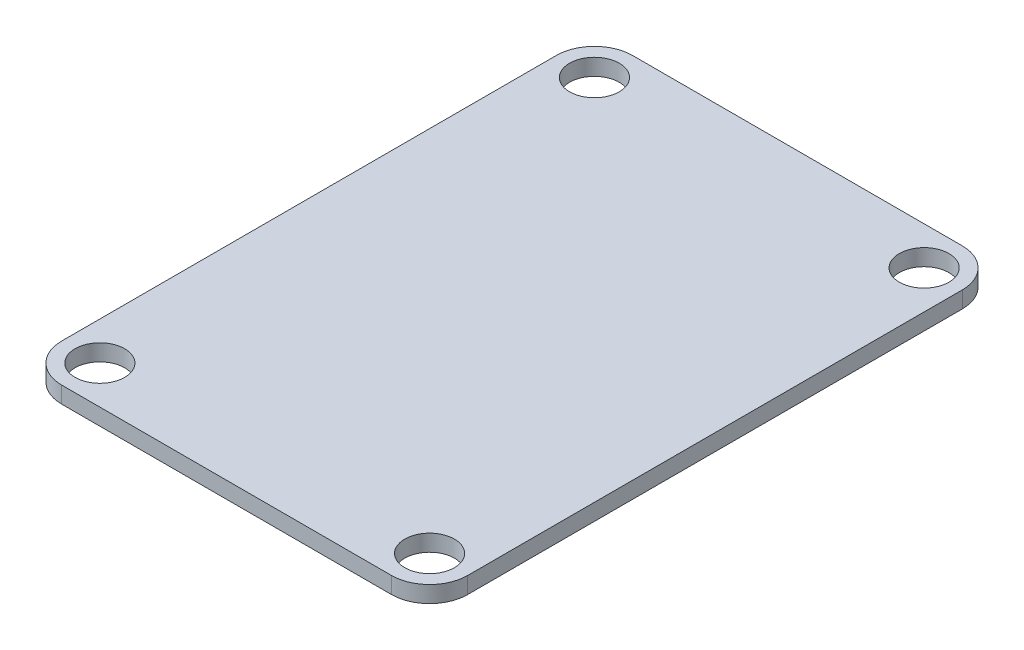
ISO-10303-21;
HEADER;
FILE_DESCRIPTION(('STEP AP214'),'2;1');
FILE_NAME('part.step','',(''),(''),'','','');
FILE_SCHEMA(('AUTOMOTIVE_DESIGN { 1 0 10303 214 1 1 1 1 }'));
ENDSEC;
DATA;
#1=APPLICATION_CONTEXT('core data for automotive mechanical design processes');
#2=APPLICATION_PROTOCOL_DEFINITION('international standard','automotive_design',2000,#1);
#3=PRODUCT_CONTEXT('',#1,'mechanical');
#4=PRODUCT('Part','Part','',(#3));
#5=PRODUCT_RELATED_PRODUCT_CATEGORY('part','',(#4));
#6=PRODUCT_DEFINITION_FORMATION('','',#4);
#7=PRODUCT_DEFINITION_CONTEXT('part definition',#1,'design');
#8=PRODUCT_DEFINITION('design','',#6,#7);
#9=PRODUCT_DEFINITION_SHAPE('','',#8);
#10=(LENGTH_UNIT() NAMED_UNIT(*) SI_UNIT(.MILLI.,.METRE.));
#11=(NAMED_UNIT(*) PLANE_ANGLE_UNIT() SI_UNIT($,.RADIAN.));
#12=(NAMED_UNIT(*) SI_UNIT($,.STERADIAN.) SOLID_ANGLE_UNIT());
#13=UNCERTAINTY_MEASURE_WITH_UNIT(LENGTH_MEASURE(1.E-05),#10,'distance_accuracy_value','');
#14=(GEOMETRIC_REPRESENTATION_CONTEXT(3) GLOBAL_UNCERTAINTY_ASSIGNED_CONTEXT((#13)) GLOBAL_UNIT_ASSIGNED_CONTEXT((#10,
#11,#12)) REPRESENTATION_CONTEXT('',''));
#15=CARTESIAN_POINT('',(0.,0.,0.));
#16=DIRECTION('',(0.,0.,1.));
#17=DIRECTION('',(1.,0.,0.));
#18=AXIS2_PLACEMENT_3D('',#15,#16,#17);
#19=CARTESIAN_POINT('',(-15.94,1.6,23.91));
#20=DIRECTION('',(0.,1.,0.));
#21=DIRECTION('',(0.,0.,1.));
#22=AXIS2_PLACEMENT_3D('',#19,#20,#21);
#23=PLANE('',#22);
#24=CARTESIAN_POINT('',(-15.94,1.6,23.91));
#25=DIRECTION('',(0.,1.,0.));
#26=DIRECTION('',(0.,0.,1.));
#27=AXIS2_PLACEMENT_3D('',#24,#25,#26);
#28=CIRCLE('',#27,2.4);
#29=CARTESIAN_POINT('',(-15.94,1.6,26.31));
#30=VERTEX_POINT('',#29);
#31=EDGE_CURVE('E188',#30,#30,#28,.T.);
#32=ORIENTED_EDGE('',*,*,#31,.F.);
#33=EDGE_LOOP('',(#32));
#34=FACE_BOUND('',#33,.T.);
#35=CARTESIAN_POINT('',(15.94,1.6,-23.91));
#36=DIRECTION('',(0.,1.,0.));
#37=DIRECTION('',(0.,0.,1.));
#38=AXIS2_PLACEMENT_3D('',#35,#36,#37);
#39=CIRCLE('',#38,2.4);
#40=CARTESIAN_POINT('',(15.94,1.6,-21.51));
#41=VERTEX_POINT('',#40);
#42=EDGE_CURVE('E134',#41,#41,#39,.T.);
#43=ORIENTED_EDGE('',*,*,#42,.F.);
#44=EDGE_LOOP('',(#43));
#45=FACE_BOUND('',#44,.T.);
#46=CARTESIAN_POINT('',(-15.94,1.6,23.91));
#47=DIRECTION('',(0.,1.,0.));
#48=DIRECTION('',(0.,0.,1.));
#49=AXIS2_PLACEMENT_3D('',#46,#47,#48);
#50=CIRCLE('',#49,3.69);
#51=CARTESIAN_POINT('',(-19.63,1.6,23.91));
#52=VERTEX_POINT('',#51);
#53=CARTESIAN_POINT('',(-15.94,1.6,27.6));
#54=VERTEX_POINT('',#53);
#55=EDGE_CURVE('E145',#52,#54,#50,.T.);
#56=ORIENTED_EDGE('',*,*,#55,.T.);
#57=DIRECTION('',(1.,0.,0.));
#58=VECTOR('',#57,1.);
#59=CARTESIAN_POINT('',(-15.94,1.6,27.6));
#60=LINE('',#59,#58);
#61=CARTESIAN_POINT('',(15.94,1.6,27.6));
#62=VERTEX_POINT('',#61);
#63=EDGE_CURVE('E93',#54,#62,#60,.T.);
#64=ORIENTED_EDGE('',*,*,#63,.T.);
#65=CARTESIAN_POINT('',(15.94,1.6,23.91));
#66=DIRECTION('',(0.,1.,0.));
#67=DIRECTION('',(0.,0.,1.));
#68=AXIS2_PLACEMENT_3D('',#65,#66,#67);
#69=CIRCLE('',#68,3.69);
#70=CARTESIAN_POINT('',(19.63,1.6,23.91));
#71=VERTEX_POINT('',#70);
#72=EDGE_CURVE('E160',#62,#71,#69,.T.);
#73=ORIENTED_EDGE('',*,*,#72,.T.);
#74=DIRECTION('',(0.,0.,-1.));
#75=VECTOR('',#74,1.);
#76=CARTESIAN_POINT('',(19.63,1.6,-23.91));
#77=LINE('',#76,#75);
#78=CARTESIAN_POINT('',(19.63,1.6,-23.91));
#79=VERTEX_POINT('',#78);
#80=EDGE_CURVE('E173',#71,#79,#77,.T.);
#81=ORIENTED_EDGE('',*,*,#80,.T.);
#82=CARTESIAN_POINT('',(15.94,1.6,-23.91));
#83=DIRECTION('',(0.,1.,0.));
#84=DIRECTION('',(0.,0.,-1.));
#85=AXIS2_PLACEMENT_3D('',#82,#83,#84);
#86=CIRCLE('',#85,3.68999999999999);
#87=CARTESIAN_POINT('',(15.94,1.6,-27.6));
#88=VERTEX_POINT('',#87);
#89=EDGE_CURVE('E112',#79,#88,#86,.T.);
#90=ORIENTED_EDGE('',*,*,#89,.T.);
#91=DIRECTION('',(-1.,0.,0.));
#92=VECTOR('',#91,1.);
#93=CARTESIAN_POINT('',(-15.94,1.6,-27.6));
#94=LINE('',#93,#92);
#95=CARTESIAN_POINT('',(-15.94,1.6,-27.6));
#96=VERTEX_POINT('',#95);
#97=EDGE_CURVE('E106',#88,#96,#94,.T.);
#98=ORIENTED_EDGE('',*,*,#97,.T.);
#99=CARTESIAN_POINT('',(-15.94,1.6,-23.91));
#100=DIRECTION('',(0.,1.,0.));
#101=DIRECTION('',(0.,0.,1.));
#102=AXIS2_PLACEMENT_3D('',#99,#100,#101);
#103=CIRCLE('',#102,3.69);
#104=CARTESIAN_POINT('',(-19.63,1.6,-23.91));
#105=VERTEX_POINT('',#104);
#106=EDGE_CURVE('E110',#96,#105,#103,.T.);
#107=ORIENTED_EDGE('',*,*,#106,.T.);
#108=DIRECTION('',(0.,0.,1.));
#109=VECTOR('',#108,1.);
#110=CARTESIAN_POINT('',(-19.63,1.6,-23.91));
#111=LINE('',#110,#109);
#112=EDGE_CURVE('E50',#105,#52,#111,.T.);
#113=ORIENTED_EDGE('',*,*,#112,.T.);
#114=EDGE_LOOP('',(#56,#64,#73,#81,#90,#98,#107,#113));
#115=FACE_BOUND('',#114,.T.);
#116=CARTESIAN_POINT('',(15.94,1.6,23.91));
#117=DIRECTION('',(0.,1.,0.));
#118=DIRECTION('',(0.,0.,1.));
#119=AXIS2_PLACEMENT_3D('',#116,#117,#118);
#120=CIRCLE('',#119,2.4);
#121=CARTESIAN_POINT('',(15.94,1.6,26.31));
#122=VERTEX_POINT('',#121);
#123=EDGE_CURVE('E182',#122,#122,#120,.T.);
#124=ORIENTED_EDGE('',*,*,#123,.F.);
#125=EDGE_LOOP('',(#124));
#126=FACE_BOUND('',#125,.T.);
#127=CARTESIAN_POINT('',(-15.94,1.6,-23.91));
#128=DIRECTION('',(0.,1.,0.));
#129=DIRECTION('',(0.,0.,1.));
#130=AXIS2_PLACEMENT_3D('',#127,#128,#129);
#131=CIRCLE('',#130,2.4);
#132=CARTESIAN_POINT('',(-15.94,1.6,-21.51));
#133=VERTEX_POINT('',#132);
#134=EDGE_CURVE('E194',#133,#133,#131,.T.);
#135=ORIENTED_EDGE('',*,*,#134,.F.);
#136=EDGE_LOOP('',(#135));
#137=FACE_BOUND('',#136,.T.);
#138=ADVANCED_FACE('F33',(#34,#45,#115,#126,#137),#23,.T.);
#139=CARTESIAN_POINT('',(-15.94,0.,23.91));
#140=DIRECTION('',(0.,1.,0.));
#141=DIRECTION('',(0.,0.,1.));
#142=AXIS2_PLACEMENT_3D('',#139,#140,#141);
#143=PLANE('',#142);
#144=CARTESIAN_POINT('',(-15.94,0.,23.91));
#145=DIRECTION('',(0.,1.,0.));
#146=DIRECTION('',(0.,0.,1.));
#147=AXIS2_PLACEMENT_3D('',#144,#145,#146);
#148=CIRCLE('',#147,2.4);
#149=CARTESIAN_POINT('',(-15.94,0.,26.31));
#150=VERTEX_POINT('',#149);
#151=EDGE_CURVE('E191',#150,#150,#148,.T.);
#152=ORIENTED_EDGE('',*,*,#151,.T.);
#153=EDGE_LOOP('',(#152));
#154=FACE_BOUND('',#153,.T.);
#155=CARTESIAN_POINT('',(15.94,0.,-23.91));
#156=DIRECTION('',(0.,1.,0.));
#157=DIRECTION('',(0.,0.,1.));
#158=AXIS2_PLACEMENT_3D('',#155,#156,#157);
#159=CIRCLE('',#158,2.4);
#160=CARTESIAN_POINT('',(15.94,0.,-21.51));
#161=VERTEX_POINT('',#160);
#162=EDGE_CURVE('E179',#161,#161,#159,.T.);
#163=ORIENTED_EDGE('',*,*,#162,.T.);
#164=EDGE_LOOP('',(#163));
#165=FACE_BOUND('',#164,.T.);
#166=CARTESIAN_POINT('',(-15.94,0.,23.91));
#167=DIRECTION('',(0.,1.,0.));
#168=DIRECTION('',(0.,0.,1.));
#169=AXIS2_PLACEMENT_3D('',#166,#167,#168);
#170=CIRCLE('',#169,3.69);
#171=CARTESIAN_POINT('',(-19.63,0.,23.91));
#172=VERTEX_POINT('',#171);
#173=CARTESIAN_POINT('',(-15.94,0.,27.6));
#174=VERTEX_POINT('',#173);
#175=EDGE_CURVE('E130',#172,#174,#170,.T.);
#176=ORIENTED_EDGE('',*,*,#175,.F.);
#177=DIRECTION('',(0.,0.,1.));
#178=VECTOR('',#177,1.);
#179=CARTESIAN_POINT('',(-19.63,0.,-23.91));
#180=LINE('',#179,#178);
#181=CARTESIAN_POINT('',(-19.63,0.,-23.91));
#182=VERTEX_POINT('',#181);
#183=EDGE_CURVE('E85',#182,#172,#180,.T.);
#184=ORIENTED_EDGE('',*,*,#183,.F.);
#185=CARTESIAN_POINT('',(-15.94,0.,-23.91));
#186=DIRECTION('',(0.,1.,0.));
#187=DIRECTION('',(0.,0.,1.));
#188=AXIS2_PLACEMENT_3D('',#185,#186,#187);
#189=CIRCLE('',#188,3.69);
#190=CARTESIAN_POINT('',(-15.94,0.,-27.6));
#191=VERTEX_POINT('',#190);
#192=EDGE_CURVE('E79',#191,#182,#189,.T.);
#193=ORIENTED_EDGE('',*,*,#192,.F.);
#194=DIRECTION('',(-1.,0.,0.));
#195=VECTOR('',#194,1.);
#196=CARTESIAN_POINT('',(-15.94,0.,-27.6));
#197=LINE('',#196,#195);
#198=CARTESIAN_POINT('',(15.94,0.,-27.6));
#199=VERTEX_POINT('',#198);
#200=EDGE_CURVE('E120',#199,#191,#197,.T.);
#201=ORIENTED_EDGE('',*,*,#200,.F.);
#202=CARTESIAN_POINT('',(15.94,0.,-23.91));
#203=DIRECTION('',(0.,1.,0.));
#204=DIRECTION('',(0.,0.,-1.));
#205=AXIS2_PLACEMENT_3D('',#202,#203,#204);
#206=CIRCLE('',#205,3.68999999999999);
#207=CARTESIAN_POINT('',(19.63,0.,-23.91));
#208=VERTEX_POINT('',#207);
#209=EDGE_CURVE('E140',#208,#199,#206,.T.);
#210=ORIENTED_EDGE('',*,*,#209,.F.);
#211=DIRECTION('',(0.,0.,-1.));
#212=VECTOR('',#211,1.);
#213=CARTESIAN_POINT('',(19.63,0.,-23.91));
#214=LINE('',#213,#212);
#215=CARTESIAN_POINT('',(19.63,0.,23.91));
#216=VERTEX_POINT('',#215);
#217=EDGE_CURVE('E138',#216,#208,#214,.T.);
#218=ORIENTED_EDGE('',*,*,#217,.F.);
#219=CARTESIAN_POINT('',(15.94,0.,23.91));
#220=DIRECTION('',(0.,1.,0.));
#221=DIRECTION('',(0.,0.,1.));
#222=AXIS2_PLACEMENT_3D('',#219,#220,#221);
#223=CIRCLE('',#222,3.69);
#224=CARTESIAN_POINT('',(15.94,0.,27.6));
#225=VERTEX_POINT('',#224);
#226=EDGE_CURVE('E136',#225,#216,#223,.T.);
#227=ORIENTED_EDGE('',*,*,#226,.F.);
#228=DIRECTION('',(1.,0.,0.));
#229=VECTOR('',#228,1.);
#230=CARTESIAN_POINT('',(-15.94,0.,27.6));
#231=LINE('',#230,#229);
#232=EDGE_CURVE('E133',#174,#225,#231,.T.);
#233=ORIENTED_EDGE('',*,*,#232,.F.);
#234=EDGE_LOOP('',(#176,#184,#193,#201,#210,#218,#227,#233));
#235=FACE_BOUND('',#234,.T.);
#236=CARTESIAN_POINT('',(15.94,0.,23.91));
#237=DIRECTION('',(0.,1.,0.));
#238=DIRECTION('',(0.,0.,1.));
#239=AXIS2_PLACEMENT_3D('',#236,#237,#238);
#240=CIRCLE('',#239,2.4);
#241=CARTESIAN_POINT('',(15.94,0.,26.31));
#242=VERTEX_POINT('',#241);
#243=EDGE_CURVE('E185',#242,#242,#240,.T.);
#244=ORIENTED_EDGE('',*,*,#243,.T.);
#245=EDGE_LOOP('',(#244));
#246=FACE_BOUND('',#245,.T.);
#247=CARTESIAN_POINT('',(-15.94,0.,-23.91));
#248=DIRECTION('',(0.,1.,0.));
#249=DIRECTION('',(0.,0.,1.));
#250=AXIS2_PLACEMENT_3D('',#247,#248,#249);
#251=CIRCLE('',#250,2.4);
#252=CARTESIAN_POINT('',(-15.94,0.,-21.51));
#253=VERTEX_POINT('',#252);
#254=EDGE_CURVE('E197',#253,#253,#251,.T.);
#255=ORIENTED_EDGE('',*,*,#254,.T.);
#256=EDGE_LOOP('',(#255));
#257=FACE_BOUND('',#256,.T.);
#258=ADVANCED_FACE('F164',(#154,#165,#235,#246,#257),#143,.F.);
#259=CARTESIAN_POINT('',(-15.94,1.6,23.91));
#260=DIRECTION('',(0.,-1.,0.));
#261=DIRECTION('',(0.,0.,-1.));
#262=AXIS2_PLACEMENT_3D('',#259,#260,#261);
#263=CYLINDRICAL_SURFACE('',#262,3.69);
#264=ORIENTED_EDGE('',*,*,#175,.T.);
#265=DIRECTION('',(0.,-1.,0.));
#266=VECTOR('',#265,1.);
#267=CARTESIAN_POINT('',(-15.94,1.6,27.6));
#268=LINE('',#267,#266);
#269=EDGE_CURVE('E11',#54,#174,#268,.T.);
#270=ORIENTED_EDGE('',*,*,#269,.F.);
#271=ORIENTED_EDGE('',*,*,#55,.F.);
#272=DIRECTION('',(0.,-1.,0.));
#273=VECTOR('',#272,1.);
#274=CARTESIAN_POINT('',(-19.63,1.6,23.91));
#275=LINE('',#274,#273);
#276=EDGE_CURVE('E126',#52,#172,#275,.T.);
#277=ORIENTED_EDGE('',*,*,#276,.T.);
#278=EDGE_LOOP('',(#264,#270,#271,#277));
#279=FACE_BOUND('',#278,.T.);
#280=ADVANCED_FACE('F35',(#279),#263,.T.);
#281=CARTESIAN_POINT('',(-15.94,1.6,27.6));
#282=DIRECTION('',(0.,0.,-1.));
#283=DIRECTION('',(-1.,0.,0.));
#284=AXIS2_PLACEMENT_3D('',#281,#282,#283);
#285=PLANE('',#284);
#286=ORIENTED_EDGE('',*,*,#232,.T.);
#287=DIRECTION('',(0.,-1.,0.));
#288=VECTOR('',#287,1.);
#289=CARTESIAN_POINT('',(15.94,1.6,27.6));
#290=LINE('',#289,#288);
#291=EDGE_CURVE('E42',#62,#225,#290,.T.);
#292=ORIENTED_EDGE('',*,*,#291,.F.);
#293=ORIENTED_EDGE('',*,*,#63,.F.);
#294=ORIENTED_EDGE('',*,*,#269,.T.);
#295=EDGE_LOOP('',(#286,#292,#293,#294));
#296=FACE_BOUND('',#295,.T.);
#297=ADVANCED_FACE('F232',(#296),#285,.F.);
#298=CARTESIAN_POINT('',(15.94,1.6,23.91));
#299=DIRECTION('',(0.,-1.,0.));
#300=DIRECTION('',(0.,0.,-1.));
#301=AXIS2_PLACEMENT_3D('',#298,#299,#300);
#302=CYLINDRICAL_SURFACE('',#301,3.69);
#303=ORIENTED_EDGE('',*,*,#226,.T.);
#304=DIRECTION('',(0.,-1.,0.));
#305=VECTOR('',#304,1.);
#306=CARTESIAN_POINT('',(19.63,1.6,23.91));
#307=LINE('',#306,#305);
#308=EDGE_CURVE('E152',#71,#216,#307,.T.);
#309=ORIENTED_EDGE('',*,*,#308,.F.);
#310=ORIENTED_EDGE('',*,*,#72,.F.);
#311=ORIENTED_EDGE('',*,*,#291,.T.);
#312=EDGE_LOOP('',(#303,#309,#310,#311));
#313=FACE_BOUND('',#312,.T.);
#314=ADVANCED_FACE('F158',(#313),#302,.T.);
#315=CARTESIAN_POINT('',(19.63,1.6,-23.91));
#316=DIRECTION('',(-1.,0.,0.));
#317=DIRECTION('',(0.,0.,1.));
#318=AXIS2_PLACEMENT_3D('',#315,#316,#317);
#319=PLANE('',#318);
#320=ORIENTED_EDGE('',*,*,#217,.T.);
#321=DIRECTION('',(0.,-1.,0.));
#322=VECTOR('',#321,1.);
#323=CARTESIAN_POINT('',(19.63,1.6,-23.91));
#324=LINE('',#323,#322);
#325=EDGE_CURVE('E149',#79,#208,#324,.T.);
#326=ORIENTED_EDGE('',*,*,#325,.F.);
#327=ORIENTED_EDGE('',*,*,#80,.F.);
#328=ORIENTED_EDGE('',*,*,#308,.T.);
#329=EDGE_LOOP('',(#320,#326,#327,#328));
#330=FACE_BOUND('',#329,.T.);
#331=ADVANCED_FACE('F169',(#330),#319,.F.);
#332=CARTESIAN_POINT('',(15.94,1.6,-23.91));
#333=DIRECTION('',(0.,-1.,0.));
#334=DIRECTION('',(0.,0.,-1.));
#335=AXIS2_PLACEMENT_3D('',#332,#333,#334);
#336=CYLINDRICAL_SURFACE('',#335,3.68999999999999);
#337=ORIENTED_EDGE('',*,*,#209,.T.);
#338=DIRECTION('',(0.,-1.,0.));
#339=VECTOR('',#338,1.);
#340=CARTESIAN_POINT('',(15.94,1.6,-27.6));
#341=LINE('',#340,#339);
#342=EDGE_CURVE('E121',#88,#199,#341,.T.);
#343=ORIENTED_EDGE('',*,*,#342,.F.);
#344=ORIENTED_EDGE('',*,*,#89,.F.);
#345=ORIENTED_EDGE('',*,*,#325,.T.);
#346=EDGE_LOOP('',(#337,#343,#344,#345));
#347=FACE_BOUND('',#346,.T.);
#348=ADVANCED_FACE('F172',(#347),#336,.T.);
#349=CARTESIAN_POINT('',(-15.94,1.6,-27.6));
#350=DIRECTION('',(0.,0.,1.));
#351=DIRECTION('',(1.,0.,0.));
#352=AXIS2_PLACEMENT_3D('',#349,#350,#351);
#353=PLANE('',#352);
#354=ORIENTED_EDGE('',*,*,#200,.T.);
#355=DIRECTION('',(0.,-1.,0.));
#356=VECTOR('',#355,1.);
#357=CARTESIAN_POINT('',(-15.94,1.6,-27.6));
#358=LINE('',#357,#356);
#359=EDGE_CURVE('E117',#96,#191,#358,.T.);
#360=ORIENTED_EDGE('',*,*,#359,.F.);
#361=ORIENTED_EDGE('',*,*,#97,.F.);
#362=ORIENTED_EDGE('',*,*,#342,.T.);
#363=EDGE_LOOP('',(#354,#360,#361,#362));
#364=FACE_BOUND('',#363,.T.);
#365=ADVANCED_FACE('F118',(#364),#353,.F.);
#366=CARTESIAN_POINT('',(-15.94,1.6,-23.91));
#367=DIRECTION('',(0.,-1.,0.));
#368=DIRECTION('',(0.,0.,-1.));
#369=AXIS2_PLACEMENT_3D('',#366,#367,#368);
#370=CYLINDRICAL_SURFACE('',#369,3.69);
#371=ORIENTED_EDGE('',*,*,#192,.T.);
#372=DIRECTION('',(0.,-1.,0.));
#373=VECTOR('',#372,1.);
#374=CARTESIAN_POINT('',(-19.63,1.6,-23.91));
#375=LINE('',#374,#373);
#376=EDGE_CURVE('E122',#105,#182,#375,.T.);
#377=ORIENTED_EDGE('',*,*,#376,.F.);
#378=ORIENTED_EDGE('',*,*,#106,.F.);
#379=ORIENTED_EDGE('',*,*,#359,.T.);
#380=EDGE_LOOP('',(#371,#377,#378,#379));
#381=FACE_BOUND('',#380,.T.);
#382=ADVANCED_FACE('F124',(#381),#370,.T.);
#383=CARTESIAN_POINT('',(-19.63,1.6,-23.91));
#384=DIRECTION('',(1.,0.,0.));
#385=DIRECTION('',(0.,0.,-1.));
#386=AXIS2_PLACEMENT_3D('',#383,#384,#385);
#387=PLANE('',#386);
#388=ORIENTED_EDGE('',*,*,#183,.T.);
#389=ORIENTED_EDGE('',*,*,#276,.F.);
#390=ORIENTED_EDGE('',*,*,#112,.F.);
#391=ORIENTED_EDGE('',*,*,#376,.T.);
#392=EDGE_LOOP('',(#388,#389,#390,#391));
#393=FACE_BOUND('',#392,.T.);
#394=ADVANCED_FACE('F220',(#393),#387,.F.);
#395=CARTESIAN_POINT('',(15.94,1.6,-23.91));
#396=DIRECTION('',(0.,-1.,0.));
#397=DIRECTION('',(0.,0.,-1.));
#398=AXIS2_PLACEMENT_3D('',#395,#396,#397);
#399=CYLINDRICAL_SURFACE('',#398,2.4);
#400=ORIENTED_EDGE('',*,*,#42,.T.);
#401=EDGE_LOOP('',(#400));
#402=FACE_BOUND('',#401,.T.);
#403=ORIENTED_EDGE('',*,*,#162,.F.);
#404=EDGE_LOOP('',(#403));
#405=FACE_BOUND('',#404,.T.);
#406=ADVANCED_FACE('F217',(#402,#405),#399,.F.);
#407=CARTESIAN_POINT('',(15.94,1.6,23.91));
#408=DIRECTION('',(0.,-1.,0.));
#409=DIRECTION('',(0.,0.,-1.));
#410=AXIS2_PLACEMENT_3D('',#407,#408,#409);
#411=CYLINDRICAL_SURFACE('',#410,2.4);
#412=ORIENTED_EDGE('',*,*,#123,.T.);
#413=EDGE_LOOP('',(#412));
#414=FACE_BOUND('',#413,.T.);
#415=ORIENTED_EDGE('',*,*,#243,.F.);
#416=EDGE_LOOP('',(#415));
#417=FACE_BOUND('',#416,.T.);
#418=ADVANCED_FACE('F296',(#414,#417),#411,.F.);
#419=CARTESIAN_POINT('',(-15.94,1.6,23.91));
#420=DIRECTION('',(0.,-1.,0.));
#421=DIRECTION('',(0.,0.,-1.));
#422=AXIS2_PLACEMENT_3D('',#419,#420,#421);
#423=CYLINDRICAL_SURFACE('',#422,2.4);
#424=ORIENTED_EDGE('',*,*,#31,.T.);
#425=EDGE_LOOP('',(#424));
#426=FACE_BOUND('',#425,.T.);
#427=ORIENTED_EDGE('',*,*,#151,.F.);
#428=EDGE_LOOP('',(#427));
#429=FACE_BOUND('',#428,.T.);
#430=ADVANCED_FACE('F304',(#426,#429),#423,.F.);
#431=CARTESIAN_POINT('',(-15.94,1.6,-23.91));
#432=DIRECTION('',(0.,-1.,0.));
#433=DIRECTION('',(0.,0.,-1.));
#434=AXIS2_PLACEMENT_3D('',#431,#432,#433);
#435=CYLINDRICAL_SURFACE('',#434,2.4);
#436=ORIENTED_EDGE('',*,*,#134,.T.);
#437=EDGE_LOOP('',(#436));
#438=FACE_BOUND('',#437,.T.);
#439=ORIENTED_EDGE('',*,*,#254,.F.);
#440=EDGE_LOOP('',(#439));
#441=FACE_BOUND('',#440,.T.);
#442=ADVANCED_FACE('F203',(#438,#441),#435,.F.);
#443=CLOSED_SHELL('',(#138,#258,#280,#297,#314,#331,#348,#365,#382,#394,#406,#418,#430,#442));
#444=MANIFOLD_SOLID_BREP('B2',#443);
#445=ADVANCED_BREP_SHAPE_REPRESENTATION('',(#18,#444),#14);
#446=SHAPE_DEFINITION_REPRESENTATION(#9,#445);
ENDSEC;
END-ISO-10303-21;
